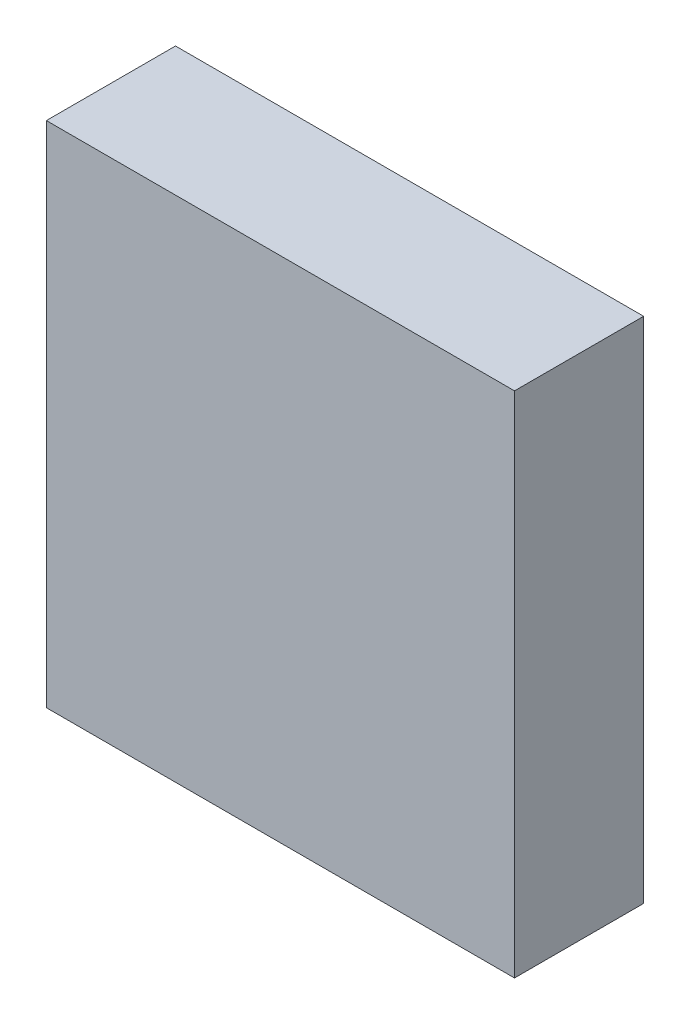
ISO-10303-21;
HEADER;
FILE_DESCRIPTION(('STEP AP214'),'2;1');
FILE_NAME('part.step','',(''),(''),'','','');
FILE_SCHEMA(('AUTOMOTIVE_DESIGN { 1 0 10303 214 1 1 1 1 }'));
ENDSEC;
DATA;
#1=APPLICATION_CONTEXT('core data for automotive mechanical design processes');
#2=APPLICATION_PROTOCOL_DEFINITION('international standard','automotive_design',2000,#1);
#3=PRODUCT_CONTEXT('',#1,'mechanical');
#4=PRODUCT('Part','Part','',(#3));
#5=PRODUCT_RELATED_PRODUCT_CATEGORY('part','',(#4));
#6=PRODUCT_DEFINITION_FORMATION('','',#4);
#7=PRODUCT_DEFINITION_CONTEXT('part definition',#1,'design');
#8=PRODUCT_DEFINITION('design','',#6,#7);
#9=PRODUCT_DEFINITION_SHAPE('','',#8);
#10=(LENGTH_UNIT() NAMED_UNIT(*) SI_UNIT(.MILLI.,.METRE.));
#11=(NAMED_UNIT(*) PLANE_ANGLE_UNIT() SI_UNIT($,.RADIAN.));
#12=(NAMED_UNIT(*) SI_UNIT($,.STERADIAN.) SOLID_ANGLE_UNIT());
#13=UNCERTAINTY_MEASURE_WITH_UNIT(LENGTH_MEASURE(1.E-05),#10,'distance_accuracy_value','');
#14=(GEOMETRIC_REPRESENTATION_CONTEXT(3) GLOBAL_UNCERTAINTY_ASSIGNED_CONTEXT((#13)) GLOBAL_UNIT_ASSIGNED_CONTEXT((#10,
#11,#12)) REPRESENTATION_CONTEXT('',''));
#15=CARTESIAN_POINT('',(0.,0.,0.));
#16=DIRECTION('',(0.,0.,1.));
#17=DIRECTION('',(1.,0.,0.));
#18=AXIS2_PLACEMENT_3D('',#15,#16,#17);
#19=CARTESIAN_POINT('',(0.,0.,16.));
#20=DIRECTION('',(1.,0.,0.));
#21=DIRECTION('',(0.,0.,-1.));
#22=AXIS2_PLACEMENT_3D('',#19,#20,#21);
#23=PLANE('',#22);
#24=DIRECTION('',(0.,0.,-1.));
#25=VECTOR('',#24,1.);
#26=CARTESIAN_POINT('',(0.,50.3,0.));
#27=LINE('',#26,#25);
#28=CARTESIAN_POINT('',(0.,50.3,4.7625));
#29=VERTEX_POINT('',#28);
#30=CARTESIAN_POINT('',(0.,50.3,0.));
#31=VERTEX_POINT('',#30);
#32=EDGE_CURVE('E54',#29,#31,#27,.T.);
#33=ORIENTED_EDGE('',*,*,#32,.F.);
#34=DIRECTION('',(0.,1.,0.));
#35=VECTOR('',#34,1.);
#36=CARTESIAN_POINT('',(0.,50.3,4.7625));
#37=LINE('',#36,#35);
#38=CARTESIAN_POINT('',(0.,43.95,4.7625));
#39=VERTEX_POINT('',#38);
#40=EDGE_CURVE('E277',#39,#29,#37,.T.);
#41=ORIENTED_EDGE('',*,*,#40,.F.);
#42=DIRECTION('',(0.,0.,1.));
#43=VECTOR('',#42,1.);
#44=CARTESIAN_POINT('',(0.,43.95,0.));
#45=LINE('',#44,#43);
#46=CARTESIAN_POINT('',(0.,43.95,0.));
#47=VERTEX_POINT('',#46);
#48=EDGE_CURVE('E60',#47,#39,#45,.T.);
#49=ORIENTED_EDGE('',*,*,#48,.F.);
#50=DIRECTION('',(0.,-1.,0.));
#51=VECTOR('',#50,1.);
#52=CARTESIAN_POINT('',(0.,0.,0.));
#53=LINE('',#52,#51);
#54=CARTESIAN_POINT('',(0.,0.,0.));
#55=VERTEX_POINT('',#54);
#56=EDGE_CURVE('E128',#47,#55,#53,.T.);
#57=ORIENTED_EDGE('',*,*,#56,.T.);
#58=DIRECTION('',(0.,0.,-1.));
#59=VECTOR('',#58,1.);
#60=CARTESIAN_POINT('',(0.,0.,16.));
#61=LINE('',#60,#59);
#62=CARTESIAN_POINT('',(0.,0.,16.));
#63=VERTEX_POINT('',#62);
#64=EDGE_CURVE('E11',#63,#55,#61,.T.);
#65=ORIENTED_EDGE('',*,*,#64,.F.);
#66=DIRECTION('',(0.,-1.,0.));
#67=VECTOR('',#66,1.);
#68=CARTESIAN_POINT('',(0.,0.,16.));
#69=LINE('',#68,#67);
#70=CARTESIAN_POINT('',(0.,63.,16.));
#71=VERTEX_POINT('',#70);
#72=EDGE_CURVE('E139',#71,#63,#69,.T.);
#73=ORIENTED_EDGE('',*,*,#72,.F.);
#74=DIRECTION('',(0.,0.,-1.));
#75=VECTOR('',#74,1.);
#76=CARTESIAN_POINT('',(0.,63.,16.));
#77=LINE('',#76,#75);
#78=CARTESIAN_POINT('',(0.,63.,0.));
#79=VERTEX_POINT('',#78);
#80=EDGE_CURVE('E152',#71,#79,#77,.T.);
#81=ORIENTED_EDGE('',*,*,#80,.T.);
#82=EDGE_CURVE('E133',#79,#31,#53,.T.);
#83=ORIENTED_EDGE('',*,*,#82,.T.);
#84=EDGE_LOOP('',(#33,#41,#49,#57,#65,#73,#81,#83));
#85=FACE_BOUND('',#84,.T.);
#86=ADVANCED_FACE('F39',(#85),#23,.F.);
#87=CARTESIAN_POINT('',(0.,0.,16.));
#88=DIRECTION('',(0.,1.,0.));
#89=DIRECTION('',(0.,0.,1.));
#90=AXIS2_PLACEMENT_3D('',#87,#88,#89);
#91=PLANE('',#90);
#92=DIRECTION('',(1.,0.,0.));
#93=VECTOR('',#92,1.);
#94=CARTESIAN_POINT('',(0.,0.,0.));
#95=LINE('',#94,#93);
#96=CARTESIAN_POINT('',(58.,0.,0.));
#97=VERTEX_POINT('',#96);
#98=EDGE_CURVE('E155',#55,#97,#95,.T.);
#99=ORIENTED_EDGE('',*,*,#98,.T.);
#100=DIRECTION('',(0.,0.,-1.));
#101=VECTOR('',#100,1.);
#102=CARTESIAN_POINT('',(58.,0.,16.));
#103=LINE('',#102,#101);
#104=CARTESIAN_POINT('',(58.,0.,16.));
#105=VERTEX_POINT('',#104);
#106=EDGE_CURVE('E47',#105,#97,#103,.T.);
#107=ORIENTED_EDGE('',*,*,#106,.F.);
#108=DIRECTION('',(1.,0.,0.));
#109=VECTOR('',#108,1.);
#110=CARTESIAN_POINT('',(0.,0.,16.));
#111=LINE('',#110,#109);
#112=EDGE_CURVE('E143',#63,#105,#111,.T.);
#113=ORIENTED_EDGE('',*,*,#112,.F.);
#114=ORIENTED_EDGE('',*,*,#64,.T.);
#115=EDGE_LOOP('',(#99,#107,#113,#114));
#116=FACE_BOUND('',#115,.T.);
#117=ADVANCED_FACE('F187',(#116),#91,.F.);
#118=CARTESIAN_POINT('',(58.,0.,16.));
#119=DIRECTION('',(-1.,0.,0.));
#120=DIRECTION('',(0.,0.,1.));
#121=AXIS2_PLACEMENT_3D('',#118,#119,#120);
#122=PLANE('',#121);
#123=DIRECTION('',(0.,1.,0.));
#124=VECTOR('',#123,1.);
#125=CARTESIAN_POINT('',(58.,0.,0.));
#126=LINE('',#125,#124);
#127=CARTESIAN_POINT('',(58.,63.,0.));
#128=VERTEX_POINT('',#127);
#129=EDGE_CURVE('E158',#97,#128,#126,.T.);
#130=ORIENTED_EDGE('',*,*,#129,.T.);
#131=DIRECTION('',(0.,0.,-1.));
#132=VECTOR('',#131,1.);
#133=CARTESIAN_POINT('',(58.,63.,16.));
#134=LINE('',#133,#132);
#135=CARTESIAN_POINT('',(58.,63.,16.));
#136=VERTEX_POINT('',#135);
#137=EDGE_CURVE('E166',#136,#128,#134,.T.);
#138=ORIENTED_EDGE('',*,*,#137,.F.);
#139=DIRECTION('',(0.,1.,0.));
#140=VECTOR('',#139,1.);
#141=CARTESIAN_POINT('',(58.,0.,16.));
#142=LINE('',#141,#140);
#143=EDGE_CURVE('E147',#105,#136,#142,.T.);
#144=ORIENTED_EDGE('',*,*,#143,.F.);
#145=ORIENTED_EDGE('',*,*,#106,.T.);
#146=EDGE_LOOP('',(#130,#138,#144,#145));
#147=FACE_BOUND('',#146,.T.);
#148=ADVANCED_FACE('F175',(#147),#122,.F.);
#149=CARTESIAN_POINT('',(0.,63.,16.));
#150=DIRECTION('',(0.,-1.,0.));
#151=DIRECTION('',(0.,0.,-1.));
#152=AXIS2_PLACEMENT_3D('',#149,#150,#151);
#153=PLANE('',#152);
#154=DIRECTION('',(-1.,0.,0.));
#155=VECTOR('',#154,1.);
#156=CARTESIAN_POINT('',(0.,63.,0.));
#157=LINE('',#156,#155);
#158=EDGE_CURVE('E144',#128,#79,#157,.T.);
#159=ORIENTED_EDGE('',*,*,#158,.T.);
#160=ORIENTED_EDGE('',*,*,#80,.F.);
#161=DIRECTION('',(-1.,0.,0.));
#162=VECTOR('',#161,1.);
#163=CARTESIAN_POINT('',(0.,63.,16.));
#164=LINE('',#163,#162);
#165=EDGE_CURVE('E150',#136,#71,#164,.T.);
#166=ORIENTED_EDGE('',*,*,#165,.F.);
#167=ORIENTED_EDGE('',*,*,#137,.T.);
#168=EDGE_LOOP('',(#159,#160,#166,#167));
#169=FACE_BOUND('',#168,.T.);
#170=ADVANCED_FACE('F181',(#169),#153,.F.);
#171=CARTESIAN_POINT('',(0.,0.,16.));
#172=DIRECTION('',(0.,0.,-1.));
#173=DIRECTION('',(-1.,0.,0.));
#174=AXIS2_PLACEMENT_3D('',#171,#172,#173);
#175=PLANE('',#174);
#176=ORIENTED_EDGE('',*,*,#72,.T.);
#177=ORIENTED_EDGE('',*,*,#112,.T.);
#178=ORIENTED_EDGE('',*,*,#143,.T.);
#179=ORIENTED_EDGE('',*,*,#165,.T.);
#180=EDGE_LOOP('',(#176,#177,#178,#179));
#181=FACE_BOUND('',#180,.T.);
#182=ADVANCED_FACE('F186',(#181),#175,.F.);
#183=CARTESIAN_POINT('',(0.,0.,0.));
#184=DIRECTION('',(0.,0.,-1.));
#185=DIRECTION('',(-1.,0.,0.));
#186=AXIS2_PLACEMENT_3D('',#183,#184,#185);
#187=PLANE('',#186);
#188=ORIENTED_EDGE('',*,*,#82,.F.);
#189=ORIENTED_EDGE('',*,*,#158,.F.);
#190=ORIENTED_EDGE('',*,*,#129,.F.);
#191=ORIENTED_EDGE('',*,*,#98,.F.);
#192=ORIENTED_EDGE('',*,*,#56,.F.);
#193=DIRECTION('',(1.,0.,0.));
#194=VECTOR('',#193,1.);
#195=CARTESIAN_POINT('',(-6.35,43.95,0.));
#196=LINE('',#195,#194);
#197=CARTESIAN_POINT('',(-6.35,43.95,0.));
#198=VERTEX_POINT('',#197);
#199=EDGE_CURVE('E107',#198,#47,#196,.T.);
#200=ORIENTED_EDGE('',*,*,#199,.F.);
#201=DIRECTION('',(0.,-1.,0.));
#202=VECTOR('',#201,1.);
#203=CARTESIAN_POINT('',(-6.35,50.3,0.));
#204=LINE('',#203,#202);
#205=CARTESIAN_POINT('',(-6.35,50.3,0.));
#206=VERTEX_POINT('',#205);
#207=EDGE_CURVE('E114',#206,#198,#204,.T.);
#208=ORIENTED_EDGE('',*,*,#207,.F.);
#209=DIRECTION('',(1.,0.,0.));
#210=VECTOR('',#209,1.);
#211=CARTESIAN_POINT('',(-6.35,50.3,0.));
#212=LINE('',#211,#210);
#213=EDGE_CURVE('E274',#206,#31,#212,.T.);
#214=ORIENTED_EDGE('',*,*,#213,.T.);
#215=EDGE_LOOP('',(#188,#189,#190,#191,#192,#200,#208,#214));
#216=FACE_BOUND('',#215,.T.);
#217=ADVANCED_FACE('F126',(#216),#187,.T.);
#218=CARTESIAN_POINT('',(-6.35,43.95,0.));
#219=DIRECTION('',(0.,1.,0.));
#220=DIRECTION('',(0.,0.,1.));
#221=AXIS2_PLACEMENT_3D('',#218,#219,#220);
#222=PLANE('',#221);
#223=ORIENTED_EDGE('',*,*,#48,.T.);
#224=DIRECTION('',(1.,0.,0.));
#225=VECTOR('',#224,1.);
#226=CARTESIAN_POINT('',(-6.35,43.95,4.7625));
#227=LINE('',#226,#225);
#228=CARTESIAN_POINT('',(-6.35,43.95,4.7625));
#229=VERTEX_POINT('',#228);
#230=EDGE_CURVE('E109',#229,#39,#227,.T.);
#231=ORIENTED_EDGE('',*,*,#230,.F.);
#232=DIRECTION('',(0.,0.,1.));
#233=VECTOR('',#232,1.);
#234=CARTESIAN_POINT('',(-6.35,43.95,0.));
#235=LINE('',#234,#233);
#236=EDGE_CURVE('E103',#198,#229,#235,.T.);
#237=ORIENTED_EDGE('',*,*,#236,.F.);
#238=ORIENTED_EDGE('',*,*,#199,.T.);
#239=EDGE_LOOP('',(#223,#231,#237,#238));
#240=FACE_BOUND('',#239,.T.);
#241=ADVANCED_FACE('F105',(#240),#222,.F.);
#242=CARTESIAN_POINT('',(-6.35,50.3,4.7625));
#243=DIRECTION('',(0.,0.,-1.));
#244=DIRECTION('',(0.,1.,0.));
#245=AXIS2_PLACEMENT_3D('',#242,#243,#244);
#246=PLANE('',#245);
#247=ORIENTED_EDGE('',*,*,#40,.T.);
#248=DIRECTION('',(1.,0.,0.));
#249=VECTOR('',#248,1.);
#250=CARTESIAN_POINT('',(-6.35,50.3,4.7625));
#251=LINE('',#250,#249);
#252=CARTESIAN_POINT('',(-6.35,50.3,4.7625));
#253=VERTEX_POINT('',#252);
#254=EDGE_CURVE('E135',#253,#29,#251,.T.);
#255=ORIENTED_EDGE('',*,*,#254,.F.);
#256=DIRECTION('',(0.,1.,0.));
#257=VECTOR('',#256,1.);
#258=CARTESIAN_POINT('',(-6.35,50.3,4.7625));
#259=LINE('',#258,#257);
#260=EDGE_CURVE('E113',#229,#253,#259,.T.);
#261=ORIENTED_EDGE('',*,*,#260,.F.);
#262=ORIENTED_EDGE('',*,*,#230,.T.);
#263=EDGE_LOOP('',(#247,#255,#261,#262));
#264=FACE_BOUND('',#263,.T.);
#265=ADVANCED_FACE('F203',(#264),#246,.F.);
#266=CARTESIAN_POINT('',(-6.35,50.3,0.));
#267=DIRECTION('',(0.,-1.,0.));
#268=DIRECTION('',(0.,0.,-1.));
#269=AXIS2_PLACEMENT_3D('',#266,#267,#268);
#270=PLANE('',#269);
#271=ORIENTED_EDGE('',*,*,#32,.T.);
#272=ORIENTED_EDGE('',*,*,#213,.F.);
#273=DIRECTION('',(0.,0.,-1.));
#274=VECTOR('',#273,1.);
#275=CARTESIAN_POINT('',(-6.35,50.3,0.));
#276=LINE('',#275,#274);
#277=EDGE_CURVE('E119',#253,#206,#276,.T.);
#278=ORIENTED_EDGE('',*,*,#277,.F.);
#279=ORIENTED_EDGE('',*,*,#254,.T.);
#280=EDGE_LOOP('',(#271,#272,#278,#279));
#281=FACE_BOUND('',#280,.T.);
#282=ADVANCED_FACE('F206',(#281),#270,.F.);
#283=CARTESIAN_POINT('',(-6.35,0.,0.));
#284=DIRECTION('',(-1.,0.,0.));
#285=DIRECTION('',(0.,0.,1.));
#286=AXIS2_PLACEMENT_3D('',#283,#284,#285);
#287=PLANE('',#286);
#288=ORIENTED_EDGE('',*,*,#207,.T.);
#289=ORIENTED_EDGE('',*,*,#236,.T.);
#290=ORIENTED_EDGE('',*,*,#260,.T.);
#291=ORIENTED_EDGE('',*,*,#277,.T.);
#292=EDGE_LOOP('',(#288,#289,#290,#291));
#293=FACE_BOUND('',#292,.T.);
#294=ADVANCED_FACE('F117',(#293),#287,.T.);
#295=CLOSED_SHELL('',(#86,#117,#148,#170,#182,#217,#241,#265,#282,#294));
#296=MANIFOLD_SOLID_BREP('B2',#295);
#297=ADVANCED_BREP_SHAPE_REPRESENTATION('',(#18,#296),#14);
#298=SHAPE_DEFINITION_REPRESENTATION(#9,#297);
ENDSEC;
END-ISO-10303-21;
